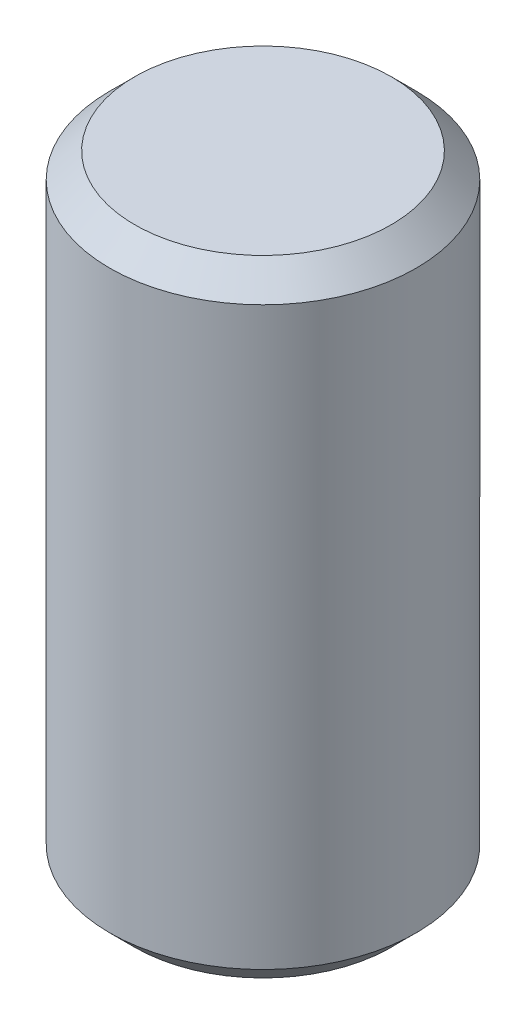
ISO-10303-21;
HEADER;
FILE_DESCRIPTION(('STEP AP214'),'2;1');
FILE_NAME('part.step','',(''),(''),'','','');
FILE_SCHEMA(('AUTOMOTIVE_DESIGN { 1 0 10303 214 1 1 1 1 }'));
ENDSEC;
DATA;
#1=APPLICATION_CONTEXT('core data for automotive mechanical design processes');
#2=APPLICATION_PROTOCOL_DEFINITION('international standard','automotive_design',2000,#1);
#3=PRODUCT_CONTEXT('',#1,'mechanical');
#4=PRODUCT('Part','Part','',(#3));
#5=PRODUCT_RELATED_PRODUCT_CATEGORY('part','',(#4));
#6=PRODUCT_DEFINITION_FORMATION('','',#4);
#7=PRODUCT_DEFINITION_CONTEXT('part definition',#1,'design');
#8=PRODUCT_DEFINITION('design','',#6,#7);
#9=PRODUCT_DEFINITION_SHAPE('','',#8);
#10=(LENGTH_UNIT() NAMED_UNIT(*) SI_UNIT(.MILLI.,.METRE.));
#11=(NAMED_UNIT(*) PLANE_ANGLE_UNIT() SI_UNIT($,.RADIAN.));
#12=(NAMED_UNIT(*) SI_UNIT($,.STERADIAN.) SOLID_ANGLE_UNIT());
#13=UNCERTAINTY_MEASURE_WITH_UNIT(LENGTH_MEASURE(1.E-05),#10,'distance_accuracy_value','');
#14=(GEOMETRIC_REPRESENTATION_CONTEXT(3) GLOBAL_UNCERTAINTY_ASSIGNED_CONTEXT((#13)) GLOBAL_UNIT_ASSIGNED_CONTEXT((#10,
#11,#12)) REPRESENTATION_CONTEXT('',''));
#15=CARTESIAN_POINT('',(0.,0.,0.));
#16=DIRECTION('',(0.,0.,1.));
#17=DIRECTION('',(1.,0.,0.));
#18=AXIS2_PLACEMENT_3D('',#15,#16,#17);
#19=CARTESIAN_POINT('',(0.,-6.35,0.));
#20=DIRECTION('',(0.,1.,0.));
#21=DIRECTION('',(0.,0.,1.));
#22=AXIS2_PLACEMENT_3D('',#19,#20,#21);
#23=PLANE('',#22);
#24=CARTESIAN_POINT('',(0.,-6.35,0.));
#25=DIRECTION('',(0.,1.,0.));
#26=DIRECTION('',(0.,0.,1.));
#27=AXIS2_PLACEMENT_3D('',#24,#25,#26);
#28=CIRCLE('',#27,2.6035);
#29=CARTESIAN_POINT('',(0.,-6.35,2.6035));
#30=VERTEX_POINT('',#29);
#31=EDGE_CURVE('E38',#30,#30,#28,.F.);
#32=ORIENTED_EDGE('',*,*,#31,.T.);
#33=EDGE_LOOP('',(#32));
#34=FACE_BOUND('',#33,.T.);
#35=ADVANCED_FACE('F31',(#34),#23,.F.);
#36=CARTESIAN_POINT('',(0.,6.08020788678209,0.));
#37=DIRECTION('',(0.,1.,0.));
#38=DIRECTION('',(0.,0.,1.));
#39=AXIS2_PLACEMENT_3D('',#36,#37,#38);
#40=CYLINDRICAL_SURFACE('',#39,3.1115);
#41=CARTESIAN_POINT('',(0.,-5.842,0.));
#42=DIRECTION('',(0.,1.,0.));
#43=DIRECTION('',(0.,0.,1.));
#44=AXIS2_PLACEMENT_3D('',#41,#42,#43);
#45=CIRCLE('',#44,3.1115);
#46=CARTESIAN_POINT('',(0.,-5.842,3.1115));
#47=VERTEX_POINT('',#46);
#48=EDGE_CURVE('E42',#47,#47,#45,.T.);
#49=ORIENTED_EDGE('',*,*,#48,.T.);
#50=EDGE_LOOP('',(#49));
#51=FACE_BOUND('',#50,.T.);
#52=CARTESIAN_POINT('',(0.,5.842,0.));
#53=DIRECTION('',(0.,-1.,0.));
#54=DIRECTION('',(0.,0.,-1.));
#55=AXIS2_PLACEMENT_3D('',#52,#53,#54);
#56=CIRCLE('',#55,3.1115);
#57=CARTESIAN_POINT('',(0.,5.842,-3.1115));
#58=VERTEX_POINT('',#57);
#59=EDGE_CURVE('E46',#58,#58,#56,.T.);
#60=ORIENTED_EDGE('',*,*,#59,.T.);
#61=EDGE_LOOP('',(#60));
#62=FACE_BOUND('',#61,.T.);
#63=ADVANCED_FACE('F52',(#51,#62),#40,.T.);
#64=CARTESIAN_POINT('',(3.1115,6.35,0.));
#65=DIRECTION('',(0.,-1.,0.));
#66=DIRECTION('',(0.,0.,-1.));
#67=AXIS2_PLACEMENT_3D('',#64,#65,#66);
#68=PLANE('',#67);
#69=CARTESIAN_POINT('',(0.,6.35,0.));
#70=DIRECTION('',(0.,-1.,0.));
#71=DIRECTION('',(0.,0.,-1.));
#72=AXIS2_PLACEMENT_3D('',#69,#70,#71);
#73=CIRCLE('',#72,2.6035);
#74=CARTESIAN_POINT('',(0.,6.35,-2.6035));
#75=VERTEX_POINT('',#74);
#76=EDGE_CURVE('E10',#75,#75,#73,.F.);
#77=ORIENTED_EDGE('',*,*,#76,.T.);
#78=EDGE_LOOP('',(#77));
#79=FACE_BOUND('',#78,.T.);
#80=ADVANCED_FACE('F60',(#79),#68,.F.);
#81=CARTESIAN_POINT('',(0.,-5.842,0.));
#82=DIRECTION('',(0.,1.,0.));
#83=DIRECTION('',(0.,0.,1.));
#84=AXIS2_PLACEMENT_3D('',#81,#82,#83);
#85=CONICAL_SURFACE('',#84,3.1115,0.785398163397448);
#86=ORIENTED_EDGE('',*,*,#31,.F.);
#87=EDGE_LOOP('',(#86));
#88=FACE_BOUND('',#87,.T.);
#89=ORIENTED_EDGE('',*,*,#48,.F.);
#90=EDGE_LOOP('',(#89));
#91=FACE_BOUND('',#90,.T.);
#92=ADVANCED_FACE('F56',(#88,#91),#85,.T.);
#93=CARTESIAN_POINT('',(0.,6.35,0.));
#94=DIRECTION('',(0.,-1.,0.));
#95=DIRECTION('',(0.,0.,-1.));
#96=AXIS2_PLACEMENT_3D('',#93,#94,#95);
#97=CONICAL_SURFACE('',#96,2.6035,0.785398163397448);
#98=ORIENTED_EDGE('',*,*,#59,.F.);
#99=EDGE_LOOP('',(#98));
#100=FACE_BOUND('',#99,.T.);
#101=ORIENTED_EDGE('',*,*,#76,.F.);
#102=EDGE_LOOP('',(#101));
#103=FACE_BOUND('',#102,.T.);
#104=ADVANCED_FACE('F33',(#100,#103),#97,.T.);
#105=CLOSED_SHELL('',(#35,#63,#80,#92,#104));
#106=MANIFOLD_SOLID_BREP('B2',#105);
#107=ADVANCED_BREP_SHAPE_REPRESENTATION('',(#18,#106),#14);
#108=SHAPE_DEFINITION_REPRESENTATION(#9,#107);
ENDSEC;
END-ISO-10303-21;
